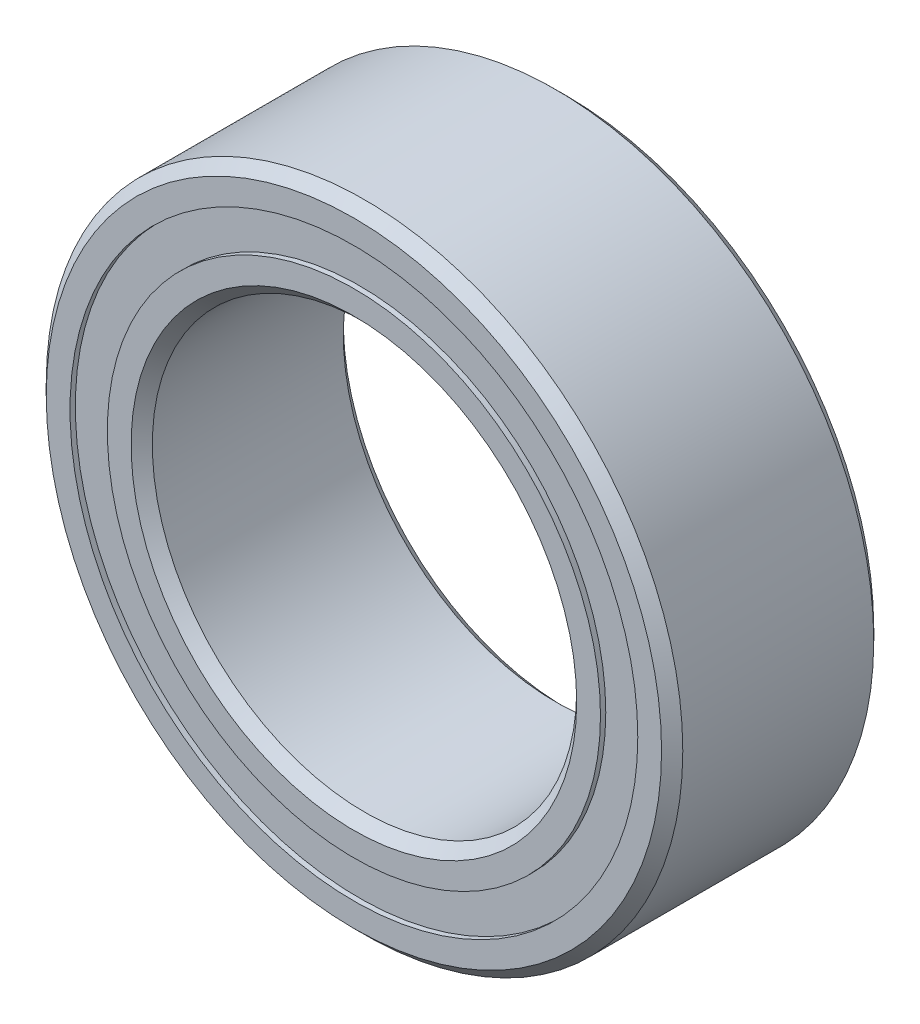
ISO-10303-21;
HEADER;
FILE_DESCRIPTION(('STEP AP214'),'2;1');
FILE_NAME('part.step','',(''),(''),'','','');
FILE_SCHEMA(('AUTOMOTIVE_DESIGN { 1 0 10303 214 1 1 1 1 }'));
ENDSEC;
DATA;
#1=APPLICATION_CONTEXT('core data for automotive mechanical design processes');
#2=APPLICATION_PROTOCOL_DEFINITION('international standard','automotive_design',2000,#1);
#3=PRODUCT_CONTEXT('',#1,'mechanical');
#4=PRODUCT('Part','Part','',(#3));
#5=PRODUCT_RELATED_PRODUCT_CATEGORY('part','',(#4));
#6=PRODUCT_DEFINITION_FORMATION('','',#4);
#7=PRODUCT_DEFINITION_CONTEXT('part definition',#1,'design');
#8=PRODUCT_DEFINITION('design','',#6,#7);
#9=PRODUCT_DEFINITION_SHAPE('','',#8);
#10=(LENGTH_UNIT() NAMED_UNIT(*) SI_UNIT(.MILLI.,.METRE.));
#11=(NAMED_UNIT(*) PLANE_ANGLE_UNIT() SI_UNIT($,.RADIAN.));
#12=(NAMED_UNIT(*) SI_UNIT($,.STERADIAN.) SOLID_ANGLE_UNIT());
#13=UNCERTAINTY_MEASURE_WITH_UNIT(LENGTH_MEASURE(1.E-05),#10,'distance_accuracy_value','');
#14=(GEOMETRIC_REPRESENTATION_CONTEXT(3) GLOBAL_UNCERTAINTY_ASSIGNED_CONTEXT((#13)) GLOBAL_UNIT_ASSIGNED_CONTEXT((#10,
#11,#12)) REPRESENTATION_CONTEXT('',''));
#15=CARTESIAN_POINT('',(0.,0.,0.));
#16=DIRECTION('',(0.,0.,1.));
#17=DIRECTION('',(1.,0.,0.));
#18=AXIS2_PLACEMENT_3D('',#15,#16,#17);
#19=CARTESIAN_POINT('',(1.98437499999998,-3.4370383212695,0.));
#20=DIRECTION('',(0.499999999999995,-0.866025403784442,0.));
#21=DIRECTION('',(0.,0.,-1.));
#22=AXIS2_PLACEMENT_3D('',#19,#20,#21);
#23=SPHERICAL_SURFACE('',#22,0.758760243513404);
#24=CARTESIAN_POINT('',(1.60499487824328,-2.77993267500523,0.));
#25=VERTEX_POINT('',#24);
#26=VERTEX_LOOP('',#25);
#27=FACE_BOUND('',#26,.T.);
#28=CARTESIAN_POINT('',(2.36375512175668,-4.09414396753378,0.));
#29=VERTEX_POINT('',#28);
#30=VERTEX_LOOP('',#29);
#31=FACE_BOUND('',#30,.T.);
#32=ADVANCED_FACE('P0_F15',(#27,#31),#23,.T.);
#33=CLOSED_SHELL('',(#32));
#34=MANIFOLD_SOLID_BREP('P0_B1',#33);
#35=CARTESIAN_POINT('',(3.4370383212695,1.98437499999999,0.));
#36=DIRECTION('',(0.86602540378444,0.499999999999998,0.));
#37=DIRECTION('',(0.,0.,-1.));
#38=AXIS2_PLACEMENT_3D('',#35,#36,#37);
#39=SPHERICAL_SURFACE('',#38,0.758760243513404);
#40=CARTESIAN_POINT('',(4.09414396753377,2.36375512175669,0.));
#41=VERTEX_POINT('',#40);
#42=VERTEX_LOOP('',#41);
#43=FACE_BOUND('',#42,.T.);
#44=CARTESIAN_POINT('',(2.77993267500522,1.60499487824329,0.));
#45=VERTEX_POINT('',#44);
#46=VERTEX_LOOP('',#45);
#47=FACE_BOUND('',#46,.T.);
#48=ADVANCED_FACE('P1_F15',(#43,#47),#39,.T.);
#49=CLOSED_SHELL('',(#48));
#50=MANIFOLD_SOLID_BREP('P1_B1',#49);
#51=CARTESIAN_POINT('',(0.,0.,0.));
#52=DIRECTION('',(0.,0.,1.));
#53=DIRECTION('',(1.,0.,0.));
#54=AXIS2_PLACEMENT_3D('',#51,#52,#53);
#55=TOROIDAL_SURFACE('',#54,3.96875,0.758760243513403);
#56=CARTESIAN_POINT('',(0.,0.,0.705555555555556));
#57=DIRECTION('',(0.,0.,1.));
#58=DIRECTION('',(1.,0.,0.));
#59=AXIS2_PLACEMENT_3D('',#56,#57,#58);
#60=CIRCLE('',#59,3.68962912087912);
#61=CARTESIAN_POINT('',(3.68962912087912,0.,0.705555555555556));
#62=VERTEX_POINT('',#61);
#63=EDGE_CURVE('P2_E32',#62,#62,#60,.T.);
#64=ORIENTED_EDGE('',*,*,#63,.F.);
#65=EDGE_LOOP('',(#64));
#66=FACE_BOUND('',#65,.T.);
#67=CARTESIAN_POINT('',(0.,0.,-0.705555555555556));
#68=DIRECTION('',(0.,0.,1.));
#69=DIRECTION('',(1.,0.,0.));
#70=AXIS2_PLACEMENT_3D('',#67,#68,#69);
#71=CIRCLE('',#70,3.68962912087912);
#72=CARTESIAN_POINT('',(3.68962912087912,0.,-0.705555555555556));
#73=VERTEX_POINT('',#72);
#74=EDGE_CURVE('P2_E30',#73,#73,#71,.F.);
#75=ORIENTED_EDGE('',*,*,#74,.F.);
#76=EDGE_LOOP('',(#75));
#77=FACE_BOUND('',#76,.T.);
#78=ADVANCED_FACE('P2_F14',(#66,#77),#55,.F.);
#79=CARTESIAN_POINT('',(0.,0.,1.5875));
#80=DIRECTION('',(0.,0.,1.));
#81=DIRECTION('',(1.,0.,0.));
#82=AXIS2_PLACEMENT_3D('',#79,#80,#81);
#83=CYLINDRICAL_SURFACE('',#82,3.68962912087912);
#84=CARTESIAN_POINT('',(0.,0.,1.5875));
#85=DIRECTION('',(0.,0.,1.));
#86=DIRECTION('',(1.,0.,0.));
#87=AXIS2_PLACEMENT_3D('',#84,#85,#86);
#88=CIRCLE('',#87,3.68962912087912);
#89=CARTESIAN_POINT('',(3.68962912087912,0.,1.5875));
#90=VERTEX_POINT('',#89);
#91=EDGE_CURVE('P2_E18',#90,#90,#88,.F.);
#92=ORIENTED_EDGE('',*,*,#91,.T.);
#93=EDGE_LOOP('',(#92));
#94=FACE_BOUND('',#93,.T.);
#95=ORIENTED_EDGE('',*,*,#63,.T.);
#96=EDGE_LOOP('',(#95));
#97=FACE_BOUND('',#96,.T.);
#98=ADVANCED_FACE('P2_F48',(#94,#97),#83,.T.);
#99=CARTESIAN_POINT('',(0.,0.,1.5875));
#100=DIRECTION('',(0.,0.,1.));
#101=DIRECTION('',(1.,0.,0.));
#102=AXIS2_PLACEMENT_3D('',#99,#100,#101);
#103=CYLINDRICAL_SURFACE('',#102,3.68962912087912);
#104=ORIENTED_EDGE('',*,*,#74,.T.);
#105=EDGE_LOOP('',(#104));
#106=FACE_BOUND('',#105,.T.);
#107=CARTESIAN_POINT('',(0.,0.,-1.5875));
#108=DIRECTION('',(0.,0.,1.));
#109=DIRECTION('',(1.,0.,0.));
#110=AXIS2_PLACEMENT_3D('',#107,#108,#109);
#111=CIRCLE('',#110,3.68962912087912);
#112=CARTESIAN_POINT('',(3.68962912087912,0.,-1.5875));
#113=VERTEX_POINT('',#112);
#114=EDGE_CURVE('P2_E41',#113,#113,#111,.T.);
#115=ORIENTED_EDGE('',*,*,#114,.T.);
#116=EDGE_LOOP('',(#115));
#117=FACE_BOUND('',#116,.T.);
#118=ADVANCED_FACE('P2_F55',(#106,#117),#103,.T.);
#119=CARTESIAN_POINT('',(0.,3.68962912087912,1.5875));
#120=DIRECTION('',(0.,0.,-1.));
#121=DIRECTION('',(-1.,0.,0.));
#122=AXIS2_PLACEMENT_3D('',#119,#120,#121);
#123=PLANE('',#122);
#124=ORIENTED_EDGE('',*,*,#91,.F.);
#125=EDGE_LOOP('',(#124));
#126=FACE_BOUND('',#125,.T.);
#127=CARTESIAN_POINT('',(0.,0.,1.58749999997099));
#128=DIRECTION('',(0.,0.,1.));
#129=DIRECTION('',(1.,0.,0.));
#130=AXIS2_PLACEMENT_3D('',#127,#128,#129);
#131=CIRCLE('',#130,3.33374999996749);
#132=CARTESIAN_POINT('',(3.33374999996749,0.,1.58749999997099));
#133=VERTEX_POINT('',#132);
#134=EDGE_CURVE('P2_E39',#133,#133,#131,.F.);
#135=ORIENTED_EDGE('',*,*,#134,.T.);
#136=EDGE_LOOP('',(#135));
#137=FACE_BOUND('',#136,.T.);
#138=ADVANCED_FACE('P2_F51',(#126,#137),#123,.F.);
#139=CARTESIAN_POINT('',(0.,3.33375,-1.5875));
#140=DIRECTION('',(0.,0.,1.));
#141=DIRECTION('',(1.,0.,0.));
#142=AXIS2_PLACEMENT_3D('',#139,#140,#141);
#143=PLANE('',#142);
#144=CARTESIAN_POINT('',(0.,0.,-1.58749999997099));
#145=DIRECTION('',(0.,0.,-1.));
#146=DIRECTION('',(0.,1.,0.));
#147=AXIS2_PLACEMENT_3D('',#144,#145,#146);
#148=CIRCLE('',#147,3.33375000002434);
#149=CARTESIAN_POINT('',(0.,3.33375000002434,-1.58749999997099));
#150=VERTEX_POINT('',#149);
#151=EDGE_CURVE('P2_E27',#150,#150,#148,.F.);
#152=ORIENTED_EDGE('',*,*,#151,.T.);
#153=EDGE_LOOP('',(#152));
#154=FACE_BOUND('',#153,.T.);
#155=ORIENTED_EDGE('',*,*,#114,.F.);
#156=EDGE_LOOP('',(#155));
#157=FACE_BOUND('',#156,.T.);
#158=ADVANCED_FACE('P2_F54',(#154,#157),#143,.F.);
#159=CARTESIAN_POINT('',(0.,0.,1.58749999991414));
#160=DIRECTION('',(0.,0.,1.));
#161=DIRECTION('',(1.,0.,0.));
#162=AXIS2_PLACEMENT_3D('',#159,#160,#161);
#163=CONICAL_SURFACE('',#162,3.33374999991065,0.785398163397448);
#164=ORIENTED_EDGE('',*,*,#134,.F.);
#165=EDGE_LOOP('',(#164));
#166=FACE_BOUND('',#165,.T.);
#167=CARTESIAN_POINT('',(0.,0.,1.42875));
#168=DIRECTION('',(0.,0.,1.));
#169=DIRECTION('',(1.,0.,0.));
#170=AXIS2_PLACEMENT_3D('',#167,#168,#169);
#171=CIRCLE('',#170,3.175);
#172=CARTESIAN_POINT('',(3.175,0.,1.42875));
#173=VERTEX_POINT('',#172);
#174=EDGE_CURVE('P2_E22',#173,#173,#171,.F.);
#175=ORIENTED_EDGE('',*,*,#174,.T.);
#176=EDGE_LOOP('',(#175));
#177=FACE_BOUND('',#176,.T.);
#178=ADVANCED_FACE('P2_F59',(#166,#177),#163,.F.);
#179=CARTESIAN_POINT('',(0.,0.,-1.58749999997099));
#180=DIRECTION('',(0.,0.,-1.));
#181=DIRECTION('',(0.,1.,0.));
#182=AXIS2_PLACEMENT_3D('',#179,#180,#181);
#183=CONICAL_SURFACE('',#182,3.33375000002434,0.785398163397448);
#184=CARTESIAN_POINT('',(0.,0.,-1.42875));
#185=DIRECTION('',(0.,0.,1.));
#186=DIRECTION('',(1.,0.,0.));
#187=AXIS2_PLACEMENT_3D('',#184,#185,#186);
#188=CIRCLE('',#187,3.175);
#189=CARTESIAN_POINT('',(3.175,0.,-1.42875));
#190=VERTEX_POINT('',#189);
#191=EDGE_CURVE('P2_E10',#190,#190,#188,.T.);
#192=ORIENTED_EDGE('',*,*,#191,.T.);
#193=EDGE_LOOP('',(#192));
#194=FACE_BOUND('',#193,.T.);
#195=ORIENTED_EDGE('',*,*,#151,.F.);
#196=EDGE_LOOP('',(#195));
#197=FACE_BOUND('',#196,.T.);
#198=ADVANCED_FACE('P2_F62',(#194,#197),#183,.F.);
#199=CARTESIAN_POINT('',(0.,0.,1.5875));
#200=DIRECTION('',(0.,0.,1.));
#201=DIRECTION('',(1.,0.,0.));
#202=AXIS2_PLACEMENT_3D('',#199,#200,#201);
#203=CYLINDRICAL_SURFACE('',#202,3.175);
#204=ORIENTED_EDGE('',*,*,#174,.F.);
#205=EDGE_LOOP('',(#204));
#206=FACE_BOUND('',#205,.T.);
#207=ORIENTED_EDGE('',*,*,#191,.F.);
#208=EDGE_LOOP('',(#207));
#209=FACE_BOUND('',#208,.T.);
#210=ADVANCED_FACE('P2_F66',(#206,#209),#203,.F.);
#211=CLOSED_SHELL('',(#78,#98,#118,#138,#158,#178,#198,#210));
#212=MANIFOLD_SOLID_BREP('P2_B1',#211);
#213=CARTESIAN_POINT('',(0.,0.,0.));
#214=DIRECTION('',(0.,0.,1.));
#215=DIRECTION('',(1.,0.,0.));
#216=AXIS2_PLACEMENT_3D('',#213,#214,#215);
#217=TOROIDAL_SURFACE('',#216,3.96875,0.758760243513404);
#218=CARTESIAN_POINT('',(0.,0.,-0.705555555555556));
#219=DIRECTION('',(0.,0.,1.));
#220=DIRECTION('',(1.,0.,0.));
#221=AXIS2_PLACEMENT_3D('',#218,#219,#220);
#222=CIRCLE('',#221,4.24787087912088);
#223=CARTESIAN_POINT('',(4.24787087912088,0.,-0.705555555555556));
#224=VERTEX_POINT('',#223);
#225=EDGE_CURVE('P3_E32',#224,#224,#222,.F.);
#226=ORIENTED_EDGE('',*,*,#225,.T.);
#227=EDGE_LOOP('',(#226));
#228=FACE_BOUND('',#227,.T.);
#229=CARTESIAN_POINT('',(0.,0.,0.705555555555555));
#230=DIRECTION('',(0.,0.,1.));
#231=DIRECTION('',(1.,0.,0.));
#232=AXIS2_PLACEMENT_3D('',#229,#230,#231);
#233=CIRCLE('',#232,4.24787087912088);
#234=CARTESIAN_POINT('',(4.24787087912088,0.,0.705555555555555));
#235=VERTEX_POINT('',#234);
#236=EDGE_CURVE('P3_E30',#235,#235,#233,.T.);
#237=ORIENTED_EDGE('',*,*,#236,.T.);
#238=EDGE_LOOP('',(#237));
#239=FACE_BOUND('',#238,.T.);
#240=ADVANCED_FACE('P3_F14',(#228,#239),#217,.F.);
#241=CARTESIAN_POINT('',(0.,0.,1.5875));
#242=DIRECTION('',(0.,0.,1.));
#243=DIRECTION('',(1.,0.,0.));
#244=AXIS2_PLACEMENT_3D('',#241,#242,#243);
#245=CYLINDRICAL_SURFACE('',#244,4.24787087912088);
#246=CARTESIAN_POINT('',(0.,0.,-1.5875));
#247=DIRECTION('',(0.,0.,1.));
#248=DIRECTION('',(1.,0.,0.));
#249=AXIS2_PLACEMENT_3D('',#246,#247,#248);
#250=CIRCLE('',#249,4.24787087912088);
#251=CARTESIAN_POINT('',(4.24787087912088,0.,-1.5875));
#252=VERTEX_POINT('',#251);
#253=EDGE_CURVE('P3_E18',#252,#252,#250,.F.);
#254=ORIENTED_EDGE('',*,*,#253,.T.);
#255=EDGE_LOOP('',(#254));
#256=FACE_BOUND('',#255,.T.);
#257=ORIENTED_EDGE('',*,*,#225,.F.);
#258=EDGE_LOOP('',(#257));
#259=FACE_BOUND('',#258,.T.);
#260=ADVANCED_FACE('P3_F48',(#256,#259),#245,.F.);
#261=CARTESIAN_POINT('',(0.,0.,1.5875));
#262=DIRECTION('',(0.,0.,1.));
#263=DIRECTION('',(1.,0.,0.));
#264=AXIS2_PLACEMENT_3D('',#261,#262,#263);
#265=CYLINDRICAL_SURFACE('',#264,4.24787087912088);
#266=ORIENTED_EDGE('',*,*,#236,.F.);
#267=EDGE_LOOP('',(#266));
#268=FACE_BOUND('',#267,.T.);
#269=CARTESIAN_POINT('',(0.,0.,1.5875));
#270=DIRECTION('',(0.,0.,1.));
#271=DIRECTION('',(1.,0.,0.));
#272=AXIS2_PLACEMENT_3D('',#269,#270,#271);
#273=CIRCLE('',#272,4.24787087912088);
#274=CARTESIAN_POINT('',(4.24787087912088,0.,1.5875));
#275=VERTEX_POINT('',#274);
#276=EDGE_CURVE('P3_E41',#275,#275,#273,.T.);
#277=ORIENTED_EDGE('',*,*,#276,.T.);
#278=EDGE_LOOP('',(#277));
#279=FACE_BOUND('',#278,.T.);
#280=ADVANCED_FACE('P3_F55',(#268,#279),#265,.F.);
#281=CARTESIAN_POINT('',(0.,4.60375,-1.5875));
#282=DIRECTION('',(0.,0.,1.));
#283=DIRECTION('',(1.,0.,0.));
#284=AXIS2_PLACEMENT_3D('',#281,#282,#283);
#285=PLANE('',#284);
#286=ORIENTED_EDGE('',*,*,#253,.F.);
#287=EDGE_LOOP('',(#286));
#288=FACE_BOUND('',#287,.T.);
#289=CARTESIAN_POINT('',(0.,0.,-1.58750000008467));
#290=DIRECTION('',(0.,0.,1.));
#291=DIRECTION('',(1.,0.,0.));
#292=AXIS2_PLACEMENT_3D('',#289,#290,#291);
#293=CIRCLE('',#292,4.60375000000113);
#294=CARTESIAN_POINT('',(4.60375000000113,0.,-1.58750000008467));
#295=VERTEX_POINT('',#294);
#296=EDGE_CURVE('P3_E39',#295,#295,#293,.T.);
#297=ORIENTED_EDGE('',*,*,#296,.F.);
#298=EDGE_LOOP('',(#297));
#299=FACE_BOUND('',#298,.T.);
#300=ADVANCED_FACE('P3_F51',(#288,#299),#285,.F.);
#301=CARTESIAN_POINT('',(0.,4.60375,1.5875));
#302=DIRECTION('',(0.,0.,-1.));
#303=DIRECTION('',(-1.,0.,0.));
#304=AXIS2_PLACEMENT_3D('',#301,#302,#303);
#305=PLANE('',#304);
#306=CARTESIAN_POINT('',(0.,0.,1.58750000008467));
#307=DIRECTION('',(0.,0.,-1.));
#308=DIRECTION('',(-1.,0.,0.));
#309=AXIS2_PLACEMENT_3D('',#306,#307,#308);
#310=CIRCLE('',#309,4.60375000000113);
#311=CARTESIAN_POINT('',(-4.60375000000113,0.,1.58750000008467));
#312=VERTEX_POINT('',#311);
#313=EDGE_CURVE('P3_E27',#312,#312,#310,.T.);
#314=ORIENTED_EDGE('',*,*,#313,.F.);
#315=EDGE_LOOP('',(#314));
#316=FACE_BOUND('',#315,.T.);
#317=ORIENTED_EDGE('',*,*,#276,.F.);
#318=EDGE_LOOP('',(#317));
#319=FACE_BOUND('',#318,.T.);
#320=ADVANCED_FACE('P3_F54',(#316,#319),#305,.F.);
#321=CARTESIAN_POINT('',(0.,0.,-1.42875000000231));
#322=DIRECTION('',(0.,0.,1.));
#323=DIRECTION('',(1.,0.,0.));
#324=AXIS2_PLACEMENT_3D('',#321,#322,#323);
#325=CONICAL_SURFACE('',#324,4.76250000002665,0.785398163218414);
#326=CARTESIAN_POINT('',(0.,0.,-1.42875));
#327=DIRECTION('',(0.,0.,1.));
#328=DIRECTION('',(1.,0.,0.));
#329=AXIS2_PLACEMENT_3D('',#326,#327,#328);
#330=CIRCLE('',#329,4.7625);
#331=CARTESIAN_POINT('',(4.7625,0.,-1.42875));
#332=VERTEX_POINT('',#331);
#333=EDGE_CURVE('P3_E22',#332,#332,#330,.T.);
#334=ORIENTED_EDGE('',*,*,#333,.F.);
#335=EDGE_LOOP('',(#334));
#336=FACE_BOUND('',#335,.T.);
#337=ORIENTED_EDGE('',*,*,#296,.T.);
#338=EDGE_LOOP('',(#337));
#339=FACE_BOUND('',#338,.T.);
#340=ADVANCED_FACE('P3_F59',(#336,#339),#325,.T.);
#341=CARTESIAN_POINT('',(0.,0.,1.42875000005915));
#342=DIRECTION('',(0.,0.,-1.));
#343=DIRECTION('',(-1.,0.,0.));
#344=AXIS2_PLACEMENT_3D('',#341,#342,#343);
#345=CONICAL_SURFACE('',#344,4.7624999999698,0.785398163218414);
#346=CARTESIAN_POINT('',(0.,0.,1.42875));
#347=DIRECTION('',(0.,0.,1.));
#348=DIRECTION('',(1.,0.,0.));
#349=AXIS2_PLACEMENT_3D('',#346,#347,#348);
#350=CIRCLE('',#349,4.7625);
#351=CARTESIAN_POINT('',(4.7625,0.,1.42875));
#352=VERTEX_POINT('',#351);
#353=EDGE_CURVE('P3_E10',#352,#352,#350,.F.);
#354=ORIENTED_EDGE('',*,*,#353,.F.);
#355=EDGE_LOOP('',(#354));
#356=FACE_BOUND('',#355,.T.);
#357=ORIENTED_EDGE('',*,*,#313,.T.);
#358=EDGE_LOOP('',(#357));
#359=FACE_BOUND('',#358,.T.);
#360=ADVANCED_FACE('P3_F61',(#356,#359),#345,.T.);
#361=CARTESIAN_POINT('',(0.,0.,1.5875));
#362=DIRECTION('',(0.,0.,1.));
#363=DIRECTION('',(1.,0.,0.));
#364=AXIS2_PLACEMENT_3D('',#361,#362,#363);
#365=CYLINDRICAL_SURFACE('',#364,4.7625);
#366=ORIENTED_EDGE('',*,*,#353,.T.);
#367=EDGE_LOOP('',(#366));
#368=FACE_BOUND('',#367,.T.);
#369=ORIENTED_EDGE('',*,*,#333,.T.);
#370=EDGE_LOOP('',(#369));
#371=FACE_BOUND('',#370,.T.);
#372=ADVANCED_FACE('P3_F69',(#368,#371),#365,.T.);
#373=CLOSED_SHELL('',(#240,#260,#280,#300,#320,#340,#360,#372));
#374=MANIFOLD_SOLID_BREP('P3_B1',#373);
#375=CARTESIAN_POINT('',(-3.96875,0.,0.));
#376=DIRECTION('',(-1.,0.,0.));
#377=DIRECTION('',(0.,0.,-1.));
#378=AXIS2_PLACEMENT_3D('',#375,#376,#377);
#379=SPHERICAL_SURFACE('',#378,0.758760243513404);
#380=CARTESIAN_POINT('',(-4.7275102435134,0.,0.));
#381=VERTEX_POINT('',#380);
#382=VERTEX_LOOP('',#381);
#383=FACE_BOUND('',#382,.T.);
#384=CARTESIAN_POINT('',(-3.2099897564866,0.,0.));
#385=VERTEX_POINT('',#384);
#386=VERTEX_LOOP('',#385);
#387=FACE_BOUND('',#386,.T.);
#388=ADVANCED_FACE('P4_F15',(#383,#387),#379,.T.);
#389=CLOSED_SHELL('',(#388));
#390=MANIFOLD_SOLID_BREP('P4_B1',#389);
#391=CARTESIAN_POINT('',(0.,4.24787087912088,-1.508125));
#392=DIRECTION('',(0.,0.,1.));
#393=DIRECTION('',(1.,0.,0.));
#394=AXIS2_PLACEMENT_3D('',#391,#392,#393);
#395=PLANE('',#394);
#396=CARTESIAN_POINT('',(0.,0.,-1.508125));
#397=DIRECTION('',(0.,0.,1.));
#398=DIRECTION('',(1.,0.,0.));
#399=AXIS2_PLACEMENT_3D('',#396,#397,#398);
#400=CIRCLE('',#399,3.68962912087912);
#401=CARTESIAN_POINT('',(3.68962912087912,0.,-1.508125));
#402=VERTEX_POINT('',#401);
#403=EDGE_CURVE('P5_E17',#402,#402,#400,.T.);
#404=ORIENTED_EDGE('',*,*,#403,.T.);
#405=EDGE_LOOP('',(#404));
#406=FACE_BOUND('',#405,.T.);
#407=CARTESIAN_POINT('',(0.,0.,-1.508125));
#408=DIRECTION('',(0.,0.,1.));
#409=DIRECTION('',(1.,0.,0.));
#410=AXIS2_PLACEMENT_3D('',#407,#408,#409);
#411=CIRCLE('',#410,4.24787087912088);
#412=CARTESIAN_POINT('',(4.24787087912088,0.,-1.508125));
#413=VERTEX_POINT('',#412);
#414=EDGE_CURVE('P5_E26',#413,#413,#411,.T.);
#415=ORIENTED_EDGE('',*,*,#414,.F.);
#416=EDGE_LOOP('',(#415));
#417=FACE_BOUND('',#416,.T.);
#418=ADVANCED_FACE('P5_F14',(#406,#417),#395,.F.);
#419=CARTESIAN_POINT('',(0.,0.,1.5875));
#420=DIRECTION('',(0.,0.,1.));
#421=DIRECTION('',(1.,0.,0.));
#422=AXIS2_PLACEMENT_3D('',#419,#420,#421);
#423=CYLINDRICAL_SURFACE('',#422,3.68962912087912);
#424=ORIENTED_EDGE('',*,*,#403,.F.);
#425=EDGE_LOOP('',(#424));
#426=FACE_BOUND('',#425,.T.);
#427=CARTESIAN_POINT('',(0.,0.,-0.758760243513405));
#428=DIRECTION('',(0.,0.,1.));
#429=DIRECTION('',(1.,0.,0.));
#430=AXIS2_PLACEMENT_3D('',#427,#428,#429);
#431=CIRCLE('',#430,3.68962912087912);
#432=CARTESIAN_POINT('',(3.68962912087912,0.,-0.758760243513405));
#433=VERTEX_POINT('',#432);
#434=EDGE_CURVE('P5_E21',#433,#433,#431,.T.);
#435=ORIENTED_EDGE('',*,*,#434,.T.);
#436=EDGE_LOOP('',(#435));
#437=FACE_BOUND('',#436,.T.);
#438=ADVANCED_FACE('P5_F36',(#426,#437),#423,.F.);
#439=CARTESIAN_POINT('',(0.,0.,1.5875));
#440=DIRECTION('',(0.,0.,1.));
#441=DIRECTION('',(1.,0.,0.));
#442=AXIS2_PLACEMENT_3D('',#439,#440,#441);
#443=CYLINDRICAL_SURFACE('',#442,4.24787087912088);
#444=CARTESIAN_POINT('',(0.,0.,-0.758760243513404));
#445=DIRECTION('',(0.,0.,1.));
#446=DIRECTION('',(1.,0.,0.));
#447=AXIS2_PLACEMENT_3D('',#444,#445,#446);
#448=CIRCLE('',#447,4.24787087912088);
#449=CARTESIAN_POINT('',(4.24787087912088,0.,-0.758760243513404));
#450=VERTEX_POINT('',#449);
#451=EDGE_CURVE('P5_E10',#450,#450,#448,.F.);
#452=ORIENTED_EDGE('',*,*,#451,.T.);
#453=EDGE_LOOP('',(#452));
#454=FACE_BOUND('',#453,.T.);
#455=ORIENTED_EDGE('',*,*,#414,.T.);
#456=EDGE_LOOP('',(#455));
#457=FACE_BOUND('',#456,.T.);
#458=ADVANCED_FACE('P5_F39',(#454,#457),#443,.T.);
#459=CARTESIAN_POINT('',(0.,4.24787087912088,-0.758760243513404));
#460=DIRECTION('',(0.,0.,-1.));
#461=DIRECTION('',(-1.,0.,0.));
#462=AXIS2_PLACEMENT_3D('',#459,#460,#461);
#463=PLANE('',#462);
#464=ORIENTED_EDGE('',*,*,#451,.F.);
#465=EDGE_LOOP('',(#464));
#466=FACE_BOUND('',#465,.T.);
#467=ORIENTED_EDGE('',*,*,#434,.F.);
#468=EDGE_LOOP('',(#467));
#469=FACE_BOUND('',#468,.T.);
#470=ADVANCED_FACE('P5_F42',(#466,#469),#463,.F.);
#471=CLOSED_SHELL('',(#418,#438,#458,#470));
#472=MANIFOLD_SOLID_BREP('P5_B1',#471);
#473=CARTESIAN_POINT('',(-1.98437500000003,-3.43703832126947,0.));
#474=DIRECTION('',(-0.500000000000007,-0.866025403784435,0.));
#475=DIRECTION('',(0.,0.,-1.));
#476=AXIS2_PLACEMENT_3D('',#473,#474,#475);
#477=SPHERICAL_SURFACE('',#476,0.758760243513404);
#478=CARTESIAN_POINT('',(-2.36375512175674,-4.09414396753375,0.));
#479=VERTEX_POINT('',#478);
#480=VERTEX_LOOP('',#479);
#481=FACE_BOUND('',#480,.T.);
#482=CARTESIAN_POINT('',(-1.60499487824332,-2.7799326750052,0.));
#483=VERTEX_POINT('',#482);
#484=VERTEX_LOOP('',#483);
#485=FACE_BOUND('',#484,.T.);
#486=ADVANCED_FACE('P6_F15',(#481,#485),#477,.T.);
#487=CLOSED_SHELL('',(#486));
#488=MANIFOLD_SOLID_BREP('P6_B1',#487);
#489=CARTESIAN_POINT('',(3.43703832126948,-1.98437500000002,0.));
#490=DIRECTION('',(0.866025403784437,-0.500000000000004,0.));
#491=DIRECTION('',(0.,0.,-1.));
#492=AXIS2_PLACEMENT_3D('',#489,#490,#491);
#493=SPHERICAL_SURFACE('',#492,0.758760243513404);
#494=CARTESIAN_POINT('',(4.09414396753376,-2.36375512175672,0.));
#495=VERTEX_POINT('',#494);
#496=VERTEX_LOOP('',#495);
#497=FACE_BOUND('',#496,.T.);
#498=CARTESIAN_POINT('',(2.77993267500521,-1.60499487824331,0.));
#499=VERTEX_POINT('',#498);
#500=VERTEX_LOOP('',#499);
#501=FACE_BOUND('',#500,.T.);
#502=ADVANCED_FACE('P7_F15',(#497,#501),#493,.T.);
#503=CLOSED_SHELL('',(#502));
#504=MANIFOLD_SOLID_BREP('P7_B1',#503);
#505=CARTESIAN_POINT('',(0.,3.96875,0.));
#506=DIRECTION('',(0.,1.,0.));
#507=DIRECTION('',(0.,0.,-1.));
#508=AXIS2_PLACEMENT_3D('',#505,#506,#507);
#509=SPHERICAL_SURFACE('',#508,0.758760243513404);
#510=CARTESIAN_POINT('',(0.,3.2099897564866,0.));
#511=VERTEX_POINT('',#510);
#512=VERTEX_LOOP('',#511);
#513=FACE_BOUND('',#512,.T.);
#514=CARTESIAN_POINT('',(0.,4.7275102435134,0.));
#515=VERTEX_POINT('',#514);
#516=VERTEX_LOOP('',#515);
#517=FACE_BOUND('',#516,.T.);
#518=ADVANCED_FACE('P8_F15',(#513,#517),#509,.T.);
#519=CLOSED_SHELL('',(#518));
#520=MANIFOLD_SOLID_BREP('P8_B1',#519);
#521=CARTESIAN_POINT('',(1.984375,3.43703832126949,0.));
#522=DIRECTION('',(0.500000000000001,0.866025403784438,0.));
#523=DIRECTION('',(0.,0.,-1.));
#524=AXIS2_PLACEMENT_3D('',#521,#522,#523);
#525=SPHERICAL_SURFACE('',#524,0.758760243513404);
#526=CARTESIAN_POINT('',(2.36375512175671,4.09414396753376,0.));
#527=VERTEX_POINT('',#526);
#528=VERTEX_LOOP('',#527);
#529=FACE_BOUND('',#528,.T.);
#530=CARTESIAN_POINT('',(1.6049948782433,2.77993267500521,0.));
#531=VERTEX_POINT('',#530);
#532=VERTEX_LOOP('',#531);
#533=FACE_BOUND('',#532,.T.);
#534=ADVANCED_FACE('P9_F15',(#529,#533),#525,.T.);
#535=CLOSED_SHELL('',(#534));
#536=MANIFOLD_SOLID_BREP('P9_B1',#535);
#537=CARTESIAN_POINT('',(-3.43703832126947,1.98437500000004,0.));
#538=DIRECTION('',(-0.866025403784433,0.50000000000001,0.));
#539=DIRECTION('',(0.,0.,-1.));
#540=AXIS2_PLACEMENT_3D('',#537,#538,#539);
#541=SPHERICAL_SURFACE('',#540,0.758760243513404);
#542=CARTESIAN_POINT('',(-4.09414396753374,2.36375512175675,0.));
#543=VERTEX_POINT('',#542);
#544=VERTEX_LOOP('',#543);
#545=FACE_BOUND('',#544,.T.);
#546=CARTESIAN_POINT('',(-2.7799326750052,1.60499487824333,0.));
#547=VERTEX_POINT('',#546);
#548=VERTEX_LOOP('',#547);
#549=FACE_BOUND('',#548,.T.);
#550=ADVANCED_FACE('P10_F15',(#545,#549),#541,.T.);
#551=CLOSED_SHELL('',(#550));
#552=MANIFOLD_SOLID_BREP('P10_B1',#551);
#553=CARTESIAN_POINT('',(3.96875,0.,0.));
#554=DIRECTION('',(1.,0.,0.));
#555=DIRECTION('',(0.,0.,-1.));
#556=AXIS2_PLACEMENT_3D('',#553,#554,#555);
#557=SPHERICAL_SURFACE('',#556,0.758760243513404);
#558=CARTESIAN_POINT('',(3.2099897564866,0.,0.));
#559=VERTEX_POINT('',#558);
#560=VERTEX_LOOP('',#559);
#561=FACE_BOUND('',#560,.T.);
#562=CARTESIAN_POINT('',(4.7275102435134,0.,0.));
#563=VERTEX_POINT('',#562);
#564=VERTEX_LOOP('',#563);
#565=FACE_BOUND('',#564,.T.);
#566=ADVANCED_FACE('P11_F15',(#561,#565),#557,.T.);
#567=CLOSED_SHELL('',(#566));
#568=MANIFOLD_SOLID_BREP('P11_B1',#567);
#569=CARTESIAN_POINT('',(-1.98437499999996,3.43703832126952,0.));
#570=DIRECTION('',(-0.499999999999989,0.866025403784445,0.));
#571=DIRECTION('',(0.,0.,-1.));
#572=AXIS2_PLACEMENT_3D('',#569,#570,#571);
#573=SPHERICAL_SURFACE('',#572,0.758760243513404);
#574=CARTESIAN_POINT('',(-2.36375512175665,4.0941439675338,0.));
#575=VERTEX_POINT('',#574);
#576=VERTEX_LOOP('',#575);
#577=FACE_BOUND('',#576,.T.);
#578=CARTESIAN_POINT('',(-1.60499487824326,2.77993267500524,0.));
#579=VERTEX_POINT('',#578);
#580=VERTEX_LOOP('',#579);
#581=FACE_BOUND('',#580,.T.);
#582=ADVANCED_FACE('P12_F15',(#577,#581),#573,.T.);
#583=CLOSED_SHELL('',(#582));
#584=MANIFOLD_SOLID_BREP('P12_B1',#583);
#585=CARTESIAN_POINT('',(0.,-3.96875,0.));
#586=DIRECTION('',(0.,-1.,0.));
#587=DIRECTION('',(0.,0.,-1.));
#588=AXIS2_PLACEMENT_3D('',#585,#586,#587);
#589=SPHERICAL_SURFACE('',#588,0.758760243513404);
#590=CARTESIAN_POINT('',(0.,-3.2099897564866,0.));
#591=VERTEX_POINT('',#590);
#592=VERTEX_LOOP('',#591);
#593=FACE_BOUND('',#592,.T.);
#594=CARTESIAN_POINT('',(0.,-4.7275102435134,0.));
#595=VERTEX_POINT('',#594);
#596=VERTEX_LOOP('',#595);
#597=FACE_BOUND('',#596,.T.);
#598=ADVANCED_FACE('P13_F15',(#593,#597),#589,.T.);
#599=CLOSED_SHELL('',(#598));
#600=MANIFOLD_SOLID_BREP('P13_B1',#599);
#601=CARTESIAN_POINT('',(0.,4.24787087912088,0.758760243513404));
#602=DIRECTION('',(0.,0.,1.));
#603=DIRECTION('',(1.,0.,0.));
#604=AXIS2_PLACEMENT_3D('',#601,#602,#603);
#605=PLANE('',#604);
#606=CARTESIAN_POINT('',(0.,0.,0.758760243513404));
#607=DIRECTION('',(0.,0.,1.));
#608=DIRECTION('',(1.,0.,0.));
#609=AXIS2_PLACEMENT_3D('',#606,#607,#608);
#610=CIRCLE('',#609,3.68962912087912);
#611=CARTESIAN_POINT('',(3.68962912087912,0.,0.758760243513404));
#612=VERTEX_POINT('',#611);
#613=EDGE_CURVE('P14_E17',#612,#612,#610,.T.);
#614=ORIENTED_EDGE('',*,*,#613,.T.);
#615=EDGE_LOOP('',(#614));
#616=FACE_BOUND('',#615,.T.);
#617=CARTESIAN_POINT('',(0.,0.,0.758760243513404));
#618=DIRECTION('',(0.,0.,1.));
#619=DIRECTION('',(1.,0.,0.));
#620=AXIS2_PLACEMENT_3D('',#617,#618,#619);
#621=CIRCLE('',#620,4.24787087912088);
#622=CARTESIAN_POINT('',(4.24787087912088,0.,0.758760243513404));
#623=VERTEX_POINT('',#622);
#624=EDGE_CURVE('P14_E26',#623,#623,#621,.T.);
#625=ORIENTED_EDGE('',*,*,#624,.F.);
#626=EDGE_LOOP('',(#625));
#627=FACE_BOUND('',#626,.T.);
#628=ADVANCED_FACE('P14_F14',(#616,#627),#605,.F.);
#629=CARTESIAN_POINT('',(0.,0.,1.5875));
#630=DIRECTION('',(0.,0.,1.));
#631=DIRECTION('',(1.,0.,0.));
#632=AXIS2_PLACEMENT_3D('',#629,#630,#631);
#633=CYLINDRICAL_SURFACE('',#632,3.68962912087912);
#634=ORIENTED_EDGE('',*,*,#613,.F.);
#635=EDGE_LOOP('',(#634));
#636=FACE_BOUND('',#635,.T.);
#637=CARTESIAN_POINT('',(0.,0.,1.508125));
#638=DIRECTION('',(0.,0.,1.));
#639=DIRECTION('',(1.,0.,0.));
#640=AXIS2_PLACEMENT_3D('',#637,#638,#639);
#641=CIRCLE('',#640,3.68962912087912);
#642=CARTESIAN_POINT('',(3.68962912087912,0.,1.508125));
#643=VERTEX_POINT('',#642);
#644=EDGE_CURVE('P14_E21',#643,#643,#641,.T.);
#645=ORIENTED_EDGE('',*,*,#644,.T.);
#646=EDGE_LOOP('',(#645));
#647=FACE_BOUND('',#646,.T.);
#648=ADVANCED_FACE('P14_F36',(#636,#647),#633,.F.);
#649=CARTESIAN_POINT('',(0.,0.,1.5875));
#650=DIRECTION('',(0.,0.,1.));
#651=DIRECTION('',(1.,0.,0.));
#652=AXIS2_PLACEMENT_3D('',#649,#650,#651);
#653=CYLINDRICAL_SURFACE('',#652,4.24787087912088);
#654=CARTESIAN_POINT('',(0.,0.,1.508125));
#655=DIRECTION('',(0.,0.,1.));
#656=DIRECTION('',(1.,0.,0.));
#657=AXIS2_PLACEMENT_3D('',#654,#655,#656);
#658=CIRCLE('',#657,4.24787087912088);
#659=CARTESIAN_POINT('',(4.24787087912088,0.,1.508125));
#660=VERTEX_POINT('',#659);
#661=EDGE_CURVE('P14_E10',#660,#660,#658,.F.);
#662=ORIENTED_EDGE('',*,*,#661,.T.);
#663=EDGE_LOOP('',(#662));
#664=FACE_BOUND('',#663,.T.);
#665=ORIENTED_EDGE('',*,*,#624,.T.);
#666=EDGE_LOOP('',(#665));
#667=FACE_BOUND('',#666,.T.);
#668=ADVANCED_FACE('P14_F39',(#664,#667),#653,.T.);
#669=CARTESIAN_POINT('',(0.,4.24787087912088,1.508125));
#670=DIRECTION('',(0.,0.,-1.));
#671=DIRECTION('',(-1.,0.,0.));
#672=AXIS2_PLACEMENT_3D('',#669,#670,#671);
#673=PLANE('',#672);
#674=ORIENTED_EDGE('',*,*,#661,.F.);
#675=EDGE_LOOP('',(#674));
#676=FACE_BOUND('',#675,.T.);
#677=ORIENTED_EDGE('',*,*,#644,.F.);
#678=EDGE_LOOP('',(#677));
#679=FACE_BOUND('',#678,.T.);
#680=ADVANCED_FACE('P14_F42',(#676,#679),#673,.F.);
#681=CLOSED_SHELL('',(#628,#648,#668,#680));
#682=MANIFOLD_SOLID_BREP('P14_B1',#681);
#683=CARTESIAN_POINT('',(-3.43703832126951,-1.98437499999997,0.));
#684=DIRECTION('',(-0.866025403784443,-0.499999999999992,0.));
#685=DIRECTION('',(0.,0.,-1.));
#686=AXIS2_PLACEMENT_3D('',#683,#684,#685);
#687=SPHERICAL_SURFACE('',#686,0.758760243513404);
#688=CARTESIAN_POINT('',(-4.09414396753379,-2.36375512175666,0.));
#689=VERTEX_POINT('',#688);
#690=VERTEX_LOOP('',#689);
#691=FACE_BOUND('',#690,.T.);
#692=CARTESIAN_POINT('',(-2.77993267500523,-1.60499487824327,0.));
#693=VERTEX_POINT('',#692);
#694=VERTEX_LOOP('',#693);
#695=FACE_BOUND('',#694,.T.);
#696=ADVANCED_FACE('P15_F15',(#691,#695),#687,.T.);
#697=CLOSED_SHELL('',(#696));
#698=MANIFOLD_SOLID_BREP('P15_B1',#697);
#699=ADVANCED_BREP_SHAPE_REPRESENTATION('',(#18,#34,#50,#212,#374,#390,#472,#488,#504,#520,#536,
#552,#568,#584,#600,#682,#698),#14);
#700=SHAPE_DEFINITION_REPRESENTATION(#9,#699);
ENDSEC;
END-ISO-10303-21;
